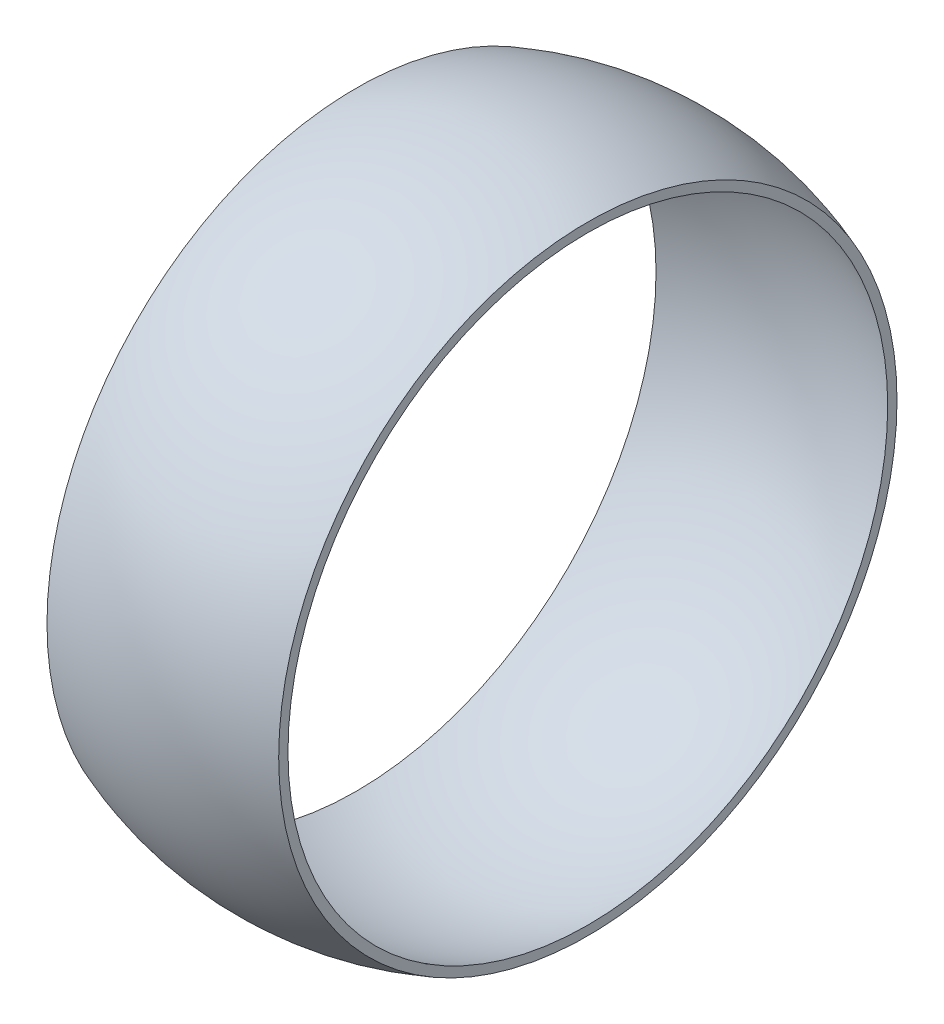
ISO-10303-21;
HEADER;
FILE_DESCRIPTION(('STEP AP214'),'2;1');
FILE_NAME('part.step','',(''),(''),'','','');
FILE_SCHEMA(('AUTOMOTIVE_DESIGN { 1 0 10303 214 1 1 1 1 }'));
ENDSEC;
DATA;
#1=APPLICATION_CONTEXT('core data for automotive mechanical design processes');
#2=APPLICATION_PROTOCOL_DEFINITION('international standard','automotive_design',2000,#1);
#3=PRODUCT_CONTEXT('',#1,'mechanical');
#4=PRODUCT('Part','Part','',(#3));
#5=PRODUCT_RELATED_PRODUCT_CATEGORY('part','',(#4));
#6=PRODUCT_DEFINITION_FORMATION('','',#4);
#7=PRODUCT_DEFINITION_CONTEXT('part definition',#1,'design');
#8=PRODUCT_DEFINITION('design','',#6,#7);
#9=PRODUCT_DEFINITION_SHAPE('','',#8);
#10=(LENGTH_UNIT() NAMED_UNIT(*) SI_UNIT(.MILLI.,.METRE.));
#11=(NAMED_UNIT(*) PLANE_ANGLE_UNIT() SI_UNIT($,.RADIAN.));
#12=(NAMED_UNIT(*) SI_UNIT($,.STERADIAN.) SOLID_ANGLE_UNIT());
#13=UNCERTAINTY_MEASURE_WITH_UNIT(LENGTH_MEASURE(1.E-05),#10,'distance_accuracy_value','');
#14=(GEOMETRIC_REPRESENTATION_CONTEXT(3) GLOBAL_UNCERTAINTY_ASSIGNED_CONTEXT((#13)) GLOBAL_UNIT_ASSIGNED_CONTEXT((#10,
#11,#12)) REPRESENTATION_CONTEXT('',''));
#15=CARTESIAN_POINT('',(0.,0.,0.));
#16=DIRECTION('',(0.,0.,1.));
#17=DIRECTION('',(1.,0.,0.));
#18=AXIS2_PLACEMENT_3D('',#15,#16,#17);
#19=CARTESIAN_POINT('',(0.,0.,0.));
#20=DIRECTION('',(1.,0.,0.));
#21=DIRECTION('',(0.,1.,0.));
#22=AXIS2_PLACEMENT_3D('',#19,#20,#21);
#23=SPHERICAL_SURFACE('',#22,11.4);
#24=CARTESIAN_POINT('',(-4.,0.,0.));
#25=DIRECTION('',(1.,0.,0.));
#26=DIRECTION('',(0.,0.,-1.));
#27=AXIS2_PLACEMENT_3D('',#24,#25,#26);
#28=CIRCLE('',#27,10.675204916066);
#29=CARTESIAN_POINT('',(-4.,0.,-10.675204916066));
#30=VERTEX_POINT('',#29);
#31=EDGE_CURVE('E10',#30,#30,#28,.T.);
#32=ORIENTED_EDGE('',*,*,#31,.T.);
#33=EDGE_LOOP('',(#32));
#34=FACE_BOUND('',#33,.T.);
#35=CARTESIAN_POINT('',(4.,0.,0.));
#36=DIRECTION('',(1.,0.,0.));
#37=DIRECTION('',(0.,0.,-1.));
#38=AXIS2_PLACEMENT_3D('',#35,#36,#37);
#39=CIRCLE('',#38,10.675204916066);
#40=CARTESIAN_POINT('',(4.,0.,-10.675204916066));
#41=VERTEX_POINT('',#40);
#42=EDGE_CURVE('E42',#41,#41,#39,.T.);
#43=ORIENTED_EDGE('',*,*,#42,.F.);
#44=EDGE_LOOP('',(#43));
#45=FACE_BOUND('',#44,.T.);
#46=ADVANCED_FACE('F28',(#34,#45),#23,.T.);
#47=CARTESIAN_POINT('',(-4.,10.675204916066,0.));
#48=DIRECTION('',(-1.,0.,0.));
#49=DIRECTION('',(0.,0.,1.));
#50=AXIS2_PLACEMENT_3D('',#47,#48,#49);
#51=PLANE('',#50);
#52=CARTESIAN_POINT('',(-4.,0.,0.));
#53=DIRECTION('',(1.,0.,0.));
#54=DIRECTION('',(0.,0.,-1.));
#55=AXIS2_PLACEMENT_3D('',#52,#53,#54);
#56=CIRCLE('',#55,10.3542261903051);
#57=CARTESIAN_POINT('',(-4.,0.,-10.3542261903051));
#58=VERTEX_POINT('',#57);
#59=EDGE_CURVE('E34',#58,#58,#56,.T.);
#60=ORIENTED_EDGE('',*,*,#59,.T.);
#61=EDGE_LOOP('',(#60));
#62=FACE_BOUND('',#61,.T.);
#63=ORIENTED_EDGE('',*,*,#31,.F.);
#64=EDGE_LOOP('',(#63));
#65=FACE_BOUND('',#64,.T.);
#66=ADVANCED_FACE('F52',(#62,#65),#51,.T.);
#67=CARTESIAN_POINT('',(0.,0.,0.));
#68=DIRECTION('',(1.,0.,0.));
#69=DIRECTION('',(0.,1.,0.));
#70=AXIS2_PLACEMENT_3D('',#67,#68,#69);
#71=SPHERICAL_SURFACE('',#70,11.1);
#72=CARTESIAN_POINT('',(4.,0.,0.));
#73=DIRECTION('',(1.,0.,0.));
#74=DIRECTION('',(0.,0.,-1.));
#75=AXIS2_PLACEMENT_3D('',#72,#73,#74);
#76=CIRCLE('',#75,10.3542261903051);
#77=CARTESIAN_POINT('',(4.,0.,-10.3542261903051));
#78=VERTEX_POINT('',#77);
#79=EDGE_CURVE('E38',#78,#78,#76,.T.);
#80=ORIENTED_EDGE('',*,*,#79,.T.);
#81=EDGE_LOOP('',(#80));
#82=FACE_BOUND('',#81,.T.);
#83=ORIENTED_EDGE('',*,*,#59,.F.);
#84=EDGE_LOOP('',(#83));
#85=FACE_BOUND('',#84,.T.);
#86=ADVANCED_FACE('F56',(#82,#85),#71,.F.);
#87=CARTESIAN_POINT('',(4.,10.675204916066,0.));
#88=DIRECTION('',(1.,0.,0.));
#89=DIRECTION('',(0.,0.,-1.));
#90=AXIS2_PLACEMENT_3D('',#87,#88,#89);
#91=PLANE('',#90);
#92=ORIENTED_EDGE('',*,*,#42,.T.);
#93=EDGE_LOOP('',(#92));
#94=FACE_BOUND('',#93,.T.);
#95=ORIENTED_EDGE('',*,*,#79,.F.);
#96=EDGE_LOOP('',(#95));
#97=FACE_BOUND('',#96,.T.);
#98=ADVANCED_FACE('F48',(#94,#97),#91,.T.);
#99=CLOSED_SHELL('',(#46,#66,#86,#98));
#100=MANIFOLD_SOLID_BREP('B2',#99);
#101=ADVANCED_BREP_SHAPE_REPRESENTATION('',(#18,#100),#14);
#102=SHAPE_DEFINITION_REPRESENTATION(#9,#101);
ENDSEC;
END-ISO-10303-21;
